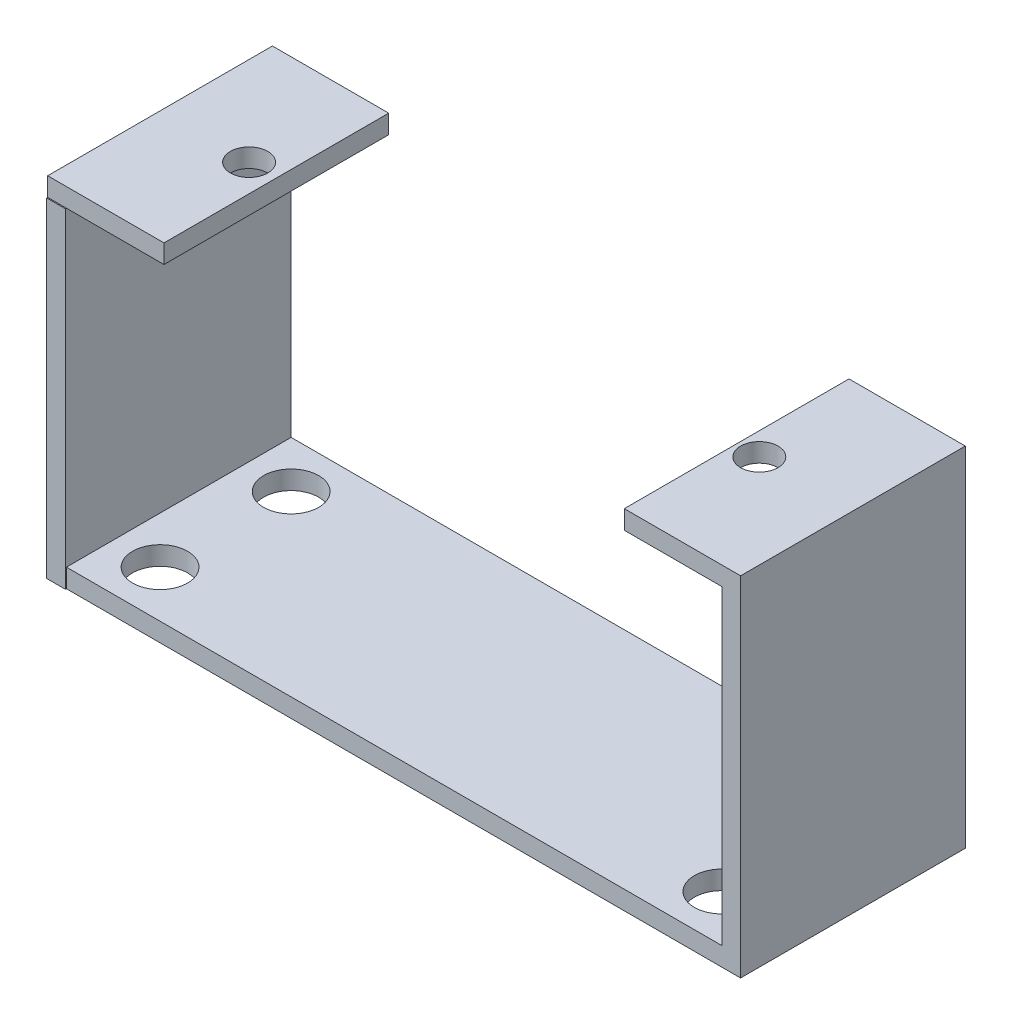
ISO-10303-21;
HEADER;
FILE_DESCRIPTION(('STEP AP214'),'2;1');
FILE_NAME('part.step','',(''),(''),'','','');
FILE_SCHEMA(('AUTOMOTIVE_DESIGN { 1 0 10303 214 1 1 1 1 }'));
ENDSEC;
DATA;
#1=APPLICATION_CONTEXT('core data for automotive mechanical design processes');
#2=APPLICATION_PROTOCOL_DEFINITION('international standard','automotive_design',2000,#1);
#3=PRODUCT_CONTEXT('',#1,'mechanical');
#4=PRODUCT('Part','Part','',(#3));
#5=PRODUCT_RELATED_PRODUCT_CATEGORY('part','',(#4));
#6=PRODUCT_DEFINITION_FORMATION('','',#4);
#7=PRODUCT_DEFINITION_CONTEXT('part definition',#1,'design');
#8=PRODUCT_DEFINITION('design','',#6,#7);
#9=PRODUCT_DEFINITION_SHAPE('','',#8);
#10=(LENGTH_UNIT() NAMED_UNIT(*) SI_UNIT(.MILLI.,.METRE.));
#11=(NAMED_UNIT(*) PLANE_ANGLE_UNIT() SI_UNIT($,.RADIAN.));
#12=(NAMED_UNIT(*) SI_UNIT($,.STERADIAN.) SOLID_ANGLE_UNIT());
#13=UNCERTAINTY_MEASURE_WITH_UNIT(LENGTH_MEASURE(1.E-05),#10,'distance_accuracy_value','');
#14=(GEOMETRIC_REPRESENTATION_CONTEXT(3) GLOBAL_UNCERTAINTY_ASSIGNED_CONTEXT((#13)) GLOBAL_UNIT_ASSIGNED_CONTEXT((#10,
#11,#12)) REPRESENTATION_CONTEXT('',''));
#15=CARTESIAN_POINT('',(0.,0.,0.));
#16=DIRECTION('',(0.,0.,1.));
#17=DIRECTION('',(1.,0.,0.));
#18=AXIS2_PLACEMENT_3D('',#15,#16,#17);
#19=CARTESIAN_POINT('',(-17.3190546528804,1.,8.56203840472674));
#20=DIRECTION('',(0.,0.,-1.));
#21=DIRECTION('',(-1.,0.,0.));
#22=AXIS2_PLACEMENT_3D('',#19,#20,#21);
#23=PLANE('',#22);
#24=DIRECTION('',(1.,0.,0.));
#25=VECTOR('',#24,1.);
#26=CARTESIAN_POINT('',(18.6809453471197,18.6,8.56203840472674));
#27=LINE('',#26,#25);
#28=CARTESIAN_POINT('',(12.4709453471196,18.6,8.56203840472674));
#29=VERTEX_POINT('',#28);
#30=CARTESIAN_POINT('',(18.6809453471197,18.6,8.56203840472674));
#31=VERTEX_POINT('',#30);
#32=EDGE_CURVE('E328',#29,#31,#27,.T.);
#33=ORIENTED_EDGE('',*,*,#32,.F.);
#34=DIRECTION('',(0.,1.,0.));
#35=VECTOR('',#34,1.);
#36=CARTESIAN_POINT('',(12.4709453471196,17.6,8.56203840472674));
#37=LINE('',#36,#35);
#38=CARTESIAN_POINT('',(12.4709453471196,17.6,8.56203840472674));
#39=VERTEX_POINT('',#38);
#40=EDGE_CURVE('E171',#39,#29,#37,.T.);
#41=ORIENTED_EDGE('',*,*,#40,.F.);
#42=DIRECTION('',(1.,0.,0.));
#43=VECTOR('',#42,1.);
#44=CARTESIAN_POINT('',(18.6809453471197,17.6,8.56203840472674));
#45=LINE('',#44,#43);
#46=CARTESIAN_POINT('',(17.6809453471197,17.6,8.56203840472674));
#47=VERTEX_POINT('',#46);
#48=EDGE_CURVE('E175',#39,#47,#45,.T.);
#49=ORIENTED_EDGE('',*,*,#48,.T.);
#50=DIRECTION('',(0.,-1.,0.));
#51=VECTOR('',#50,1.);
#52=CARTESIAN_POINT('',(17.6809453471197,0.,8.56203840472674));
#53=LINE('',#52,#51);
#54=CARTESIAN_POINT('',(17.6809453471197,1.,8.56203840472674));
#55=VERTEX_POINT('',#54);
#56=EDGE_CURVE('E192',#47,#55,#53,.T.);
#57=ORIENTED_EDGE('',*,*,#56,.T.);
#58=DIRECTION('',(1.,0.,0.));
#59=VECTOR('',#58,1.);
#60=CARTESIAN_POINT('',(-17.3190546528804,1.,8.56203840472674));
#61=LINE('',#60,#59);
#62=CARTESIAN_POINT('',(-17.3190546528804,1.,8.56203840472674));
#63=VERTEX_POINT('',#62);
#64=EDGE_CURVE('E255',#63,#55,#61,.T.);
#65=ORIENTED_EDGE('',*,*,#64,.F.);
#66=DIRECTION('',(0.,-1.,0.));
#67=VECTOR('',#66,1.);
#68=CARTESIAN_POINT('',(-17.3190546528804,1.,8.56203840472674));
#69=LINE('',#68,#67);
#70=CARTESIAN_POINT('',(-17.3190546528804,0.,8.56203840472673));
#71=VERTEX_POINT('',#70);
#72=EDGE_CURVE('E11',#63,#71,#69,.T.);
#73=ORIENTED_EDGE('',*,*,#72,.T.);
#74=DIRECTION('',(1.,0.,0.));
#75=VECTOR('',#74,1.);
#76=CARTESIAN_POINT('',(-17.3190546528804,0.,8.56203840472674));
#77=LINE('',#76,#75);
#78=CARTESIAN_POINT('',(18.6809453471197,0.,8.56203840472674));
#79=VERTEX_POINT('',#78);
#80=EDGE_CURVE('E250',#71,#79,#77,.T.);
#81=ORIENTED_EDGE('',*,*,#80,.T.);
#82=DIRECTION('',(0.,-1.,0.));
#83=VECTOR('',#82,1.);
#84=CARTESIAN_POINT('',(18.6809453471197,0.,8.56203840472674));
#85=LINE('',#84,#83);
#86=EDGE_CURVE('E193',#31,#79,#85,.T.);
#87=ORIENTED_EDGE('',*,*,#86,.F.);
#88=EDGE_LOOP('',(#33,#41,#49,#57,#65,#73,#81,#87));
#89=FACE_BOUND('',#88,.T.);
#90=ADVANCED_FACE('F39',(#89),#23,.F.);
#91=CARTESIAN_POINT('',(0.,18.6,0.));
#92=DIRECTION('',(0.,1.,0.));
#93=DIRECTION('',(0.,0.,1.));
#94=AXIS2_PLACEMENT_3D('',#91,#92,#93);
#95=PLANE('',#94);
#96=CARTESIAN_POINT('',(13.6809453471197,18.6,2.56203840472674));
#97=DIRECTION('',(0.,1.,0.));
#98=DIRECTION('',(0.,0.,1.));
#99=AXIS2_PLACEMENT_3D('',#96,#97,#98);
#100=CIRCLE('',#99,1.);
#101=CARTESIAN_POINT('',(13.6809453471197,18.6,3.56203840472674));
#102=VERTEX_POINT('',#101);
#103=EDGE_CURVE('E297',#102,#102,#100,.T.);
#104=ORIENTED_EDGE('',*,*,#103,.F.);
#105=EDGE_LOOP('',(#104));
#106=FACE_BOUND('',#105,.T.);
#107=DIRECTION('',(0.,0.,-1.));
#108=VECTOR('',#107,1.);
#109=CARTESIAN_POINT('',(12.4709453471196,18.6,8.56203840472674));
#110=LINE('',#109,#108);
#111=CARTESIAN_POINT('',(12.4709453471196,18.6,-3.43796159527326));
#112=VERTEX_POINT('',#111);
#113=EDGE_CURVE('E305',#29,#112,#110,.T.);
#114=ORIENTED_EDGE('',*,*,#113,.F.);
#115=ORIENTED_EDGE('',*,*,#32,.T.);
#116=DIRECTION('',(0.,0.,-1.));
#117=VECTOR('',#116,1.);
#118=CARTESIAN_POINT('',(18.6809453471197,18.6,8.56203840472674));
#119=LINE('',#118,#117);
#120=CARTESIAN_POINT('',(18.6809453471197,18.6,-3.43796159527326));
#121=VERTEX_POINT('',#120);
#122=EDGE_CURVE('E185',#31,#121,#119,.T.);
#123=ORIENTED_EDGE('',*,*,#122,.T.);
#124=DIRECTION('',(-1.,0.,0.));
#125=VECTOR('',#124,1.);
#126=CARTESIAN_POINT('',(18.6809453471197,18.6,-3.43796159527326));
#127=LINE('',#126,#125);
#128=EDGE_CURVE('E323',#121,#112,#127,.T.);
#129=ORIENTED_EDGE('',*,*,#128,.T.);
#130=EDGE_LOOP('',(#114,#115,#123,#129));
#131=FACE_BOUND('',#130,.T.);
#132=ADVANCED_FACE('F372',(#106,#131),#95,.T.);
#133=CARTESIAN_POINT('',(0.,17.6,0.));
#134=DIRECTION('',(0.,1.,0.));
#135=DIRECTION('',(0.,0.,1.));
#136=AXIS2_PLACEMENT_3D('',#133,#134,#135);
#137=PLANE('',#136);
#138=CARTESIAN_POINT('',(13.6809453471197,17.6,2.56203840472674));
#139=DIRECTION('',(0.,1.,0.));
#140=DIRECTION('',(0.,0.,1.));
#141=AXIS2_PLACEMENT_3D('',#138,#139,#140);
#142=CIRCLE('',#141,1.);
#143=CARTESIAN_POINT('',(13.6809453471197,17.6,3.56203840472674));
#144=VERTEX_POINT('',#143);
#145=EDGE_CURVE('E301',#144,#144,#142,.T.);
#146=ORIENTED_EDGE('',*,*,#145,.T.);
#147=EDGE_LOOP('',(#146));
#148=FACE_BOUND('',#147,.T.);
#149=ORIENTED_EDGE('',*,*,#48,.F.);
#150=DIRECTION('',(0.,0.,-1.));
#151=VECTOR('',#150,1.);
#152=CARTESIAN_POINT('',(12.4709453471196,17.6,8.56203840472674));
#153=LINE('',#152,#151);
#154=CARTESIAN_POINT('',(12.4709453471196,17.6,-3.43796159527326));
#155=VERTEX_POINT('',#154);
#156=EDGE_CURVE('E152',#39,#155,#153,.T.);
#157=ORIENTED_EDGE('',*,*,#156,.T.);
#158=DIRECTION('',(-1.,0.,0.));
#159=VECTOR('',#158,1.);
#160=CARTESIAN_POINT('',(18.6809453471197,17.6,-3.43796159527326));
#161=LINE('',#160,#159);
#162=CARTESIAN_POINT('',(17.6809453471197,17.6,-3.43796159527326));
#163=VERTEX_POINT('',#162);
#164=EDGE_CURVE('E170',#163,#155,#161,.T.);
#165=ORIENTED_EDGE('',*,*,#164,.F.);
#166=DIRECTION('',(0.,0.,1.));
#167=VECTOR('',#166,1.);
#168=CARTESIAN_POINT('',(17.6809453471197,17.6,8.56203840472674));
#169=LINE('',#168,#167);
#170=EDGE_CURVE('E198',#163,#47,#169,.T.);
#171=ORIENTED_EDGE('',*,*,#170,.T.);
#172=EDGE_LOOP('',(#149,#157,#165,#171));
#173=FACE_BOUND('',#172,.T.);
#174=ADVANCED_FACE('F352',(#148,#173),#137,.F.);
#175=CARTESIAN_POINT('',(-18.3190546528804,17.6,-3.43796159527326));
#176=DIRECTION('',(0.,-1.,0.));
#177=DIRECTION('',(0.,0.,-1.));
#178=AXIS2_PLACEMENT_3D('',#175,#176,#177);
#179=PLANE('',#178);
#180=CARTESIAN_POINT('',(-18.3190546528804,17.6,8.56203840472674));
#181=VERTEX_POINT('',#180);
#182=CARTESIAN_POINT('',(-17.3190546528804,17.6,8.56203840472674));
#183=VERTEX_POINT('',#182);
#184=EDGE_CURVE('E181',#181,#183,#45,.T.);
#185=ORIENTED_EDGE('',*,*,#184,.F.);
#186=DIRECTION('',(0.,0.,-1.));
#187=VECTOR('',#186,1.);
#188=CARTESIAN_POINT('',(-18.3190546528804,17.6,-3.43796159527326));
#189=LINE('',#188,#187);
#190=CARTESIAN_POINT('',(-18.3190546528804,17.6,8.61549422427288));
#191=VERTEX_POINT('',#190);
#192=EDGE_CURVE('E227',#191,#181,#189,.T.);
#193=ORIENTED_EDGE('',*,*,#192,.F.);
#194=DIRECTION('',(1.,0.,0.));
#195=VECTOR('',#194,1.);
#196=CARTESIAN_POINT('',(-18.3190546528804,17.6,8.61549422427288));
#197=LINE('',#196,#195);
#198=CARTESIAN_POINT('',(-17.3190546528804,17.6,8.61549422427288));
#199=VERTEX_POINT('',#198);
#200=EDGE_CURVE('E231',#191,#199,#197,.T.);
#201=ORIENTED_EDGE('',*,*,#200,.T.);
#202=DIRECTION('',(0.,0.,-1.));
#203=VECTOR('',#202,1.);
#204=CARTESIAN_POINT('',(-17.3190546528804,17.6,-3.43796159527326));
#205=LINE('',#204,#203);
#206=EDGE_CURVE('E221',#199,#183,#205,.T.);
#207=ORIENTED_EDGE('',*,*,#206,.T.);
#208=EDGE_LOOP('',(#185,#193,#201,#207));
#209=FACE_BOUND('',#208,.T.);
#210=ADVANCED_FACE('F380',(#209),#179,.F.);
#211=CARTESIAN_POINT('',(-12.1090546528804,17.6,8.56203840472674));
#212=VERTEX_POINT('',#211);
#213=EDGE_CURVE('E186',#183,#212,#45,.T.);
#214=ORIENTED_EDGE('',*,*,#213,.T.);
#215=DIRECTION('',(0.,1.,0.));
#216=VECTOR('',#215,1.);
#217=CARTESIAN_POINT('',(-12.1090546528804,17.6,8.56203840472674));
#218=LINE('',#217,#216);
#219=CARTESIAN_POINT('',(-12.1090546528804,18.6,8.56203840472674));
#220=VERTEX_POINT('',#219);
#221=EDGE_CURVE('E57',#212,#220,#218,.T.);
#222=ORIENTED_EDGE('',*,*,#221,.T.);
#223=CARTESIAN_POINT('',(-18.3190546528804,18.6,8.56203840472674));
#224=VERTEX_POINT('',#223);
#225=EDGE_CURVE('E179',#224,#220,#27,.T.);
#226=ORIENTED_EDGE('',*,*,#225,.F.);
#227=DIRECTION('',(0.,-1.,0.));
#228=VECTOR('',#227,1.);
#229=CARTESIAN_POINT('',(-18.3190546528804,18.6,8.56203840472674));
#230=LINE('',#229,#228);
#231=EDGE_CURVE('E187',#224,#181,#230,.T.);
#232=ORIENTED_EDGE('',*,*,#231,.T.);
#233=ORIENTED_EDGE('',*,*,#184,.T.);
#234=EDGE_LOOP('',(#214,#222,#226,#232,#233));
#235=FACE_BOUND('',#234,.T.);
#236=ADVANCED_FACE('F41',(#235),#23,.F.);
#237=CARTESIAN_POINT('',(-17.3190546528804,1.,-3.43796159527326));
#238=DIRECTION('',(0.,0.,1.));
#239=DIRECTION('',(1.,0.,0.));
#240=AXIS2_PLACEMENT_3D('',#237,#238,#239);
#241=PLANE('',#240);
#242=ORIENTED_EDGE('',*,*,#164,.T.);
#243=DIRECTION('',(0.,1.,0.));
#244=VECTOR('',#243,1.);
#245=CARTESIAN_POINT('',(12.4709453471196,17.6,-3.43796159527326));
#246=LINE('',#245,#244);
#247=EDGE_CURVE('E65',#155,#112,#246,.T.);
#248=ORIENTED_EDGE('',*,*,#247,.T.);
#249=ORIENTED_EDGE('',*,*,#128,.F.);
#250=DIRECTION('',(0.,1.,0.));
#251=VECTOR('',#250,1.);
#252=CARTESIAN_POINT('',(18.6809453471197,0.,-3.43796159527326));
#253=LINE('',#252,#251);
#254=CARTESIAN_POINT('',(18.6809453471197,0.,-3.43796159527326));
#255=VERTEX_POINT('',#254);
#256=EDGE_CURVE('E202',#255,#121,#253,.T.);
#257=ORIENTED_EDGE('',*,*,#256,.F.);
#258=DIRECTION('',(-1.,0.,0.));
#259=VECTOR('',#258,1.);
#260=CARTESIAN_POINT('',(-17.3190546528804,0.,-3.43796159527326));
#261=LINE('',#260,#259);
#262=CARTESIAN_POINT('',(-18.3190546528804,0.,-3.43796159527326));
#263=VERTEX_POINT('',#262);
#264=EDGE_CURVE('E256',#255,#263,#261,.T.);
#265=ORIENTED_EDGE('',*,*,#264,.T.);
#266=DIRECTION('',(0.,-1.,0.));
#267=VECTOR('',#266,1.);
#268=CARTESIAN_POINT('',(-18.3190546528804,0.,-3.43796159527326));
#269=LINE('',#268,#267);
#270=CARTESIAN_POINT('',(-18.3190546528804,18.6,-3.43796159527326));
#271=VERTEX_POINT('',#270);
#272=EDGE_CURVE('E216',#271,#263,#269,.T.);
#273=ORIENTED_EDGE('',*,*,#272,.F.);
#274=CARTESIAN_POINT('',(-12.1090546528804,18.6,-3.43796159527326));
#275=VERTEX_POINT('',#274);
#276=EDGE_CURVE('E162',#275,#271,#127,.T.);
#277=ORIENTED_EDGE('',*,*,#276,.F.);
#278=DIRECTION('',(0.,1.,0.));
#279=VECTOR('',#278,1.);
#280=CARTESIAN_POINT('',(-12.1090546528804,17.6,-3.43796159527326));
#281=LINE('',#280,#279);
#282=CARTESIAN_POINT('',(-12.1090546528804,17.6,-3.43796159527326));
#283=VERTEX_POINT('',#282);
#284=EDGE_CURVE('E146',#283,#275,#281,.T.);
#285=ORIENTED_EDGE('',*,*,#284,.F.);
#286=CARTESIAN_POINT('',(-17.3190546528804,17.6,-3.43796159527326));
#287=VERTEX_POINT('',#286);
#288=EDGE_CURVE('E159',#283,#287,#161,.T.);
#289=ORIENTED_EDGE('',*,*,#288,.T.);
#290=DIRECTION('',(0.,-1.,0.));
#291=VECTOR('',#290,1.);
#292=CARTESIAN_POINT('',(-17.3190546528804,0.,-3.43796159527326));
#293=LINE('',#292,#291);
#294=CARTESIAN_POINT('',(-17.3190546528804,1.,-3.43796159527326));
#295=VERTEX_POINT('',#294);
#296=EDGE_CURVE('E205',#287,#295,#293,.T.);
#297=ORIENTED_EDGE('',*,*,#296,.T.);
#298=DIRECTION('',(-1.,0.,0.));
#299=VECTOR('',#298,1.);
#300=CARTESIAN_POINT('',(-17.3190546528804,1.,-3.43796159527326));
#301=LINE('',#300,#299);
#302=CARTESIAN_POINT('',(17.6809453471197,1.,-3.43796159527326));
#303=VERTEX_POINT('',#302);
#304=EDGE_CURVE('E49',#303,#295,#301,.T.);
#305=ORIENTED_EDGE('',*,*,#304,.F.);
#306=DIRECTION('',(0.,1.,0.));
#307=VECTOR('',#306,1.);
#308=CARTESIAN_POINT('',(17.6809453471197,0.,-3.43796159527326));
#309=LINE('',#308,#307);
#310=EDGE_CURVE('E209',#303,#163,#309,.T.);
#311=ORIENTED_EDGE('',*,*,#310,.T.);
#312=EDGE_LOOP('',(#242,#248,#249,#257,#265,#273,#277,#285,#289,#297,#305,#311));
#313=FACE_BOUND('',#312,.T.);
#314=ADVANCED_FACE('F157',(#313),#241,.F.);
#315=CARTESIAN_POINT('',(0.,1.,0.));
#316=DIRECTION('',(0.,1.,0.));
#317=DIRECTION('',(0.,0.,1.));
#318=AXIS2_PLACEMENT_3D('',#315,#316,#317);
#319=PLANE('',#318);
#320=CARTESIAN_POINT('',(15.1809453471197,1.,6.06203840472674));
#321=DIRECTION('',(0.,1.,0.));
#322=DIRECTION('',(0.,0.,1.));
#323=AXIS2_PLACEMENT_3D('',#320,#321,#322);
#324=CIRCLE('',#323,1.47);
#325=CARTESIAN_POINT('',(15.1809453471197,1.,7.53203840472674));
#326=VERTEX_POINT('',#325);
#327=EDGE_CURVE('E470',#326,#326,#324,.T.);
#328=ORIENTED_EDGE('',*,*,#327,.F.);
#329=EDGE_LOOP('',(#328));
#330=FACE_BOUND('',#329,.T.);
#331=CARTESIAN_POINT('',(-14.8190546528804,1.,-0.937961595273264));
#332=DIRECTION('',(0.,1.,0.));
#333=DIRECTION('',(0.,0.,1.));
#334=AXIS2_PLACEMENT_3D('',#331,#332,#333);
#335=CIRCLE('',#334,1.47);
#336=CARTESIAN_POINT('',(-14.8190546528804,1.,0.532038404726734));
#337=VERTEX_POINT('',#336);
#338=EDGE_CURVE('E474',#337,#337,#335,.T.);
#339=ORIENTED_EDGE('',*,*,#338,.F.);
#340=EDGE_LOOP('',(#339));
#341=FACE_BOUND('',#340,.T.);
#342=CARTESIAN_POINT('',(-14.8190546528804,1.,6.06203840472673));
#343=DIRECTION('',(0.,1.,0.));
#344=DIRECTION('',(0.,0.,1.));
#345=AXIS2_PLACEMENT_3D('',#342,#343,#344);
#346=CIRCLE('',#345,1.47);
#347=CARTESIAN_POINT('',(-14.8190546528804,1.,7.53203840472673));
#348=VERTEX_POINT('',#347);
#349=EDGE_CURVE('E451',#348,#348,#346,.T.);
#350=ORIENTED_EDGE('',*,*,#349,.F.);
#351=EDGE_LOOP('',(#350));
#352=FACE_BOUND('',#351,.T.);
#353=CARTESIAN_POINT('',(15.1809453471197,1.,-0.937961595273264));
#354=DIRECTION('',(0.,1.,0.));
#355=DIRECTION('',(0.,0.,1.));
#356=AXIS2_PLACEMENT_3D('',#353,#354,#355);
#357=CIRCLE('',#356,1.47);
#358=CARTESIAN_POINT('',(15.1809453471197,1.,0.532038404726738));
#359=VERTEX_POINT('',#358);
#360=EDGE_CURVE('E276',#359,#359,#357,.T.);
#361=ORIENTED_EDGE('',*,*,#360,.F.);
#362=EDGE_LOOP('',(#361));
#363=FACE_BOUND('',#362,.T.);
#364=DIRECTION('',(0.,0.,1.));
#365=VECTOR('',#364,1.);
#366=CARTESIAN_POINT('',(-17.3190546528804,1.,-3.43796159527326));
#367=LINE('',#366,#365);
#368=EDGE_CURVE('E251',#295,#63,#367,.T.);
#369=ORIENTED_EDGE('',*,*,#368,.T.);
#370=ORIENTED_EDGE('',*,*,#64,.T.);
#371=DIRECTION('',(0.,0.,-1.));
#372=VECTOR('',#371,1.);
#373=CARTESIAN_POINT('',(17.6809453471197,1.,-3.43796159527326));
#374=LINE('',#373,#372);
#375=EDGE_CURVE('E260',#55,#303,#374,.T.);
#376=ORIENTED_EDGE('',*,*,#375,.T.);
#377=ORIENTED_EDGE('',*,*,#304,.T.);
#378=EDGE_LOOP('',(#369,#370,#376,#377));
#379=FACE_BOUND('',#378,.T.);
#380=ADVANCED_FACE('F357',(#330,#341,#352,#363,#379),#319,.T.);
#381=CARTESIAN_POINT('',(0.,0.,0.));
#382=DIRECTION('',(0.,1.,0.));
#383=DIRECTION('',(0.,0.,1.));
#384=AXIS2_PLACEMENT_3D('',#381,#382,#383);
#385=PLANE('',#384);
#386=CARTESIAN_POINT('',(15.1809453471197,0.,6.06203840472674));
#387=DIRECTION('',(0.,1.,0.));
#388=DIRECTION('',(0.,0.,1.));
#389=AXIS2_PLACEMENT_3D('',#386,#387,#388);
#390=CIRCLE('',#389,1.47);
#391=CARTESIAN_POINT('',(15.1809453471197,0.,7.53203840472674));
#392=VERTEX_POINT('',#391);
#393=EDGE_CURVE('E43',#392,#392,#390,.T.);
#394=ORIENTED_EDGE('',*,*,#393,.T.);
#395=EDGE_LOOP('',(#394));
#396=FACE_BOUND('',#395,.T.);
#397=CARTESIAN_POINT('',(-14.8190546528804,0.,-0.937961595273264));
#398=DIRECTION('',(0.,1.,0.));
#399=DIRECTION('',(0.,0.,1.));
#400=AXIS2_PLACEMENT_3D('',#397,#398,#399);
#401=CIRCLE('',#400,1.47);
#402=CARTESIAN_POINT('',(-14.8190546528804,0.,0.532038404726734));
#403=VERTEX_POINT('',#402);
#404=EDGE_CURVE('E279',#403,#403,#401,.T.);
#405=ORIENTED_EDGE('',*,*,#404,.T.);
#406=EDGE_LOOP('',(#405));
#407=FACE_BOUND('',#406,.T.);
#408=CARTESIAN_POINT('',(-14.8190546528804,0.,6.06203840472673));
#409=DIRECTION('',(0.,1.,0.));
#410=DIRECTION('',(0.,0.,1.));
#411=AXIS2_PLACEMENT_3D('',#408,#409,#410);
#412=CIRCLE('',#411,1.47);
#413=CARTESIAN_POINT('',(-14.8190546528804,0.,7.53203840472673));
#414=VERTEX_POINT('',#413);
#415=EDGE_CURVE('E275',#414,#414,#412,.T.);
#416=ORIENTED_EDGE('',*,*,#415,.T.);
#417=EDGE_LOOP('',(#416));
#418=FACE_BOUND('',#417,.T.);
#419=CARTESIAN_POINT('',(15.1809453471197,0.,-0.937961595273264));
#420=DIRECTION('',(0.,1.,0.));
#421=DIRECTION('',(0.,0.,1.));
#422=AXIS2_PLACEMENT_3D('',#419,#420,#421);
#423=CIRCLE('',#422,1.47);
#424=CARTESIAN_POINT('',(15.1809453471197,0.,0.532038404726738));
#425=VERTEX_POINT('',#424);
#426=EDGE_CURVE('E271',#425,#425,#423,.T.);
#427=ORIENTED_EDGE('',*,*,#426,.T.);
#428=EDGE_LOOP('',(#427));
#429=FACE_BOUND('',#428,.T.);
#430=ORIENTED_EDGE('',*,*,#80,.F.);
#431=DIRECTION('',(0.,0.,1.));
#432=VECTOR('',#431,1.);
#433=CARTESIAN_POINT('',(-17.3190546528804,0.,-3.43796159527326));
#434=LINE('',#433,#432);
#435=CARTESIAN_POINT('',(-17.3190546528804,0.,8.61549422427288));
#436=VERTEX_POINT('',#435);
#437=EDGE_CURVE('E234',#71,#436,#434,.T.);
#438=ORIENTED_EDGE('',*,*,#437,.T.);
#439=DIRECTION('',(1.,0.,0.));
#440=VECTOR('',#439,1.);
#441=CARTESIAN_POINT('',(-18.3190546528804,0.,8.61549422427288));
#442=LINE('',#441,#440);
#443=CARTESIAN_POINT('',(-18.3190546528804,0.,8.61549422427288));
#444=VERTEX_POINT('',#443);
#445=EDGE_CURVE('E246',#444,#436,#442,.T.);
#446=ORIENTED_EDGE('',*,*,#445,.F.);
#447=DIRECTION('',(0.,0.,1.));
#448=VECTOR('',#447,1.);
#449=CARTESIAN_POINT('',(-18.3190546528804,0.,-3.43796159527326));
#450=LINE('',#449,#448);
#451=EDGE_CURVE('E220',#263,#444,#450,.T.);
#452=ORIENTED_EDGE('',*,*,#451,.F.);
#453=ORIENTED_EDGE('',*,*,#264,.F.);
#454=DIRECTION('',(0.,0.,-1.));
#455=VECTOR('',#454,1.);
#456=CARTESIAN_POINT('',(18.6809453471197,0.,8.56203840472674));
#457=LINE('',#456,#455);
#458=EDGE_CURVE('E197',#79,#255,#457,.T.);
#459=ORIENTED_EDGE('',*,*,#458,.F.);
#460=EDGE_LOOP('',(#430,#438,#446,#452,#453,#459));
#461=FACE_BOUND('',#460,.T.);
#462=ADVANCED_FACE('F366',(#396,#407,#418,#429,#461),#385,.F.);
#463=CARTESIAN_POINT('',(-17.3190546528804,0.,0.));
#464=DIRECTION('',(1.,0.,0.));
#465=DIRECTION('',(0.,0.,-1.));
#466=AXIS2_PLACEMENT_3D('',#463,#464,#465);
#467=PLANE('',#466);
#468=ORIENTED_EDGE('',*,*,#72,.F.);
#469=ORIENTED_EDGE('',*,*,#368,.F.);
#470=ORIENTED_EDGE('',*,*,#296,.F.);
#471=DIRECTION('',(0.,0.,1.));
#472=VECTOR('',#471,1.);
#473=CARTESIAN_POINT('',(-17.3190546528804,17.6,0.));
#474=LINE('',#473,#472);
#475=EDGE_CURVE('E167',#287,#183,#474,.T.);
#476=ORIENTED_EDGE('',*,*,#475,.T.);
#477=ORIENTED_EDGE('',*,*,#206,.F.);
#478=DIRECTION('',(0.,1.,0.));
#479=VECTOR('',#478,1.);
#480=CARTESIAN_POINT('',(-17.3190546528804,0.,8.61549422427288));
#481=LINE('',#480,#479);
#482=EDGE_CURVE('E237',#436,#199,#481,.T.);
#483=ORIENTED_EDGE('',*,*,#482,.F.);
#484=ORIENTED_EDGE('',*,*,#437,.F.);
#485=EDGE_LOOP('',(#468,#469,#470,#476,#477,#483,#484));
#486=FACE_BOUND('',#485,.T.);
#487=ADVANCED_FACE('F359',(#486),#467,.T.);
#488=CARTESIAN_POINT('',(-18.3190546528804,0.,8.61549422427288));
#489=DIRECTION('',(0.,0.,-1.));
#490=DIRECTION('',(-1.,0.,0.));
#491=AXIS2_PLACEMENT_3D('',#488,#489,#490);
#492=PLANE('',#491);
#493=ORIENTED_EDGE('',*,*,#482,.T.);
#494=ORIENTED_EDGE('',*,*,#200,.F.);
#495=DIRECTION('',(0.,1.,0.));
#496=VECTOR('',#495,1.);
#497=CARTESIAN_POINT('',(-18.3190546528804,0.,8.61549422427288));
#498=LINE('',#497,#496);
#499=EDGE_CURVE('E224',#444,#191,#498,.T.);
#500=ORIENTED_EDGE('',*,*,#499,.F.);
#501=ORIENTED_EDGE('',*,*,#445,.T.);
#502=EDGE_LOOP('',(#493,#494,#500,#501));
#503=FACE_BOUND('',#502,.T.);
#504=ADVANCED_FACE('F382',(#503),#492,.F.);
#505=CARTESIAN_POINT('',(-18.3190546528804,0.,0.));
#506=DIRECTION('',(1.,0.,0.));
#507=DIRECTION('',(0.,0.,-1.));
#508=AXIS2_PLACEMENT_3D('',#505,#506,#507);
#509=PLANE('',#508);
#510=ORIENTED_EDGE('',*,*,#272,.T.);
#511=ORIENTED_EDGE('',*,*,#451,.T.);
#512=ORIENTED_EDGE('',*,*,#499,.T.);
#513=ORIENTED_EDGE('',*,*,#192,.T.);
#514=ORIENTED_EDGE('',*,*,#231,.F.);
#515=DIRECTION('',(0.,0.,1.));
#516=VECTOR('',#515,1.);
#517=CARTESIAN_POINT('',(-18.3190546528804,18.6,8.56203840472674));
#518=LINE('',#517,#516);
#519=EDGE_CURVE('E326',#271,#224,#518,.T.);
#520=ORIENTED_EDGE('',*,*,#519,.F.);
#521=EDGE_LOOP('',(#510,#511,#512,#513,#514,#520));
#522=FACE_BOUND('',#521,.T.);
#523=ADVANCED_FACE('F376',(#522),#509,.F.);
#524=CARTESIAN_POINT('',(17.6809453471197,0.,0.));
#525=DIRECTION('',(-1.,0.,0.));
#526=DIRECTION('',(0.,0.,1.));
#527=AXIS2_PLACEMENT_3D('',#524,#525,#526);
#528=PLANE('',#527);
#529=ORIENTED_EDGE('',*,*,#375,.F.);
#530=ORIENTED_EDGE('',*,*,#56,.F.);
#531=ORIENTED_EDGE('',*,*,#170,.F.);
#532=ORIENTED_EDGE('',*,*,#310,.F.);
#533=EDGE_LOOP('',(#529,#530,#531,#532));
#534=FACE_BOUND('',#533,.T.);
#535=ADVANCED_FACE('F354',(#534),#528,.T.);
#536=CARTESIAN_POINT('',(18.6809453471197,0.,0.));
#537=DIRECTION('',(-1.,0.,0.));
#538=DIRECTION('',(0.,0.,1.));
#539=AXIS2_PLACEMENT_3D('',#536,#537,#538);
#540=PLANE('',#539);
#541=ORIENTED_EDGE('',*,*,#86,.T.);
#542=ORIENTED_EDGE('',*,*,#458,.T.);
#543=ORIENTED_EDGE('',*,*,#256,.T.);
#544=ORIENTED_EDGE('',*,*,#122,.F.);
#545=EDGE_LOOP('',(#541,#542,#543,#544));
#546=FACE_BOUND('',#545,.T.);
#547=ADVANCED_FACE('F370',(#546),#540,.F.);
#548=CARTESIAN_POINT('',(-13.5690544530361,18.6,2.55873817580405));
#549=DIRECTION('',(0.,1.,0.));
#550=DIRECTION('',(0.,0.,1.));
#551=AXIS2_PLACEMENT_3D('',#548,#549,#550);
#552=CIRCLE('',#551,1.);
#553=CARTESIAN_POINT('',(-13.5690544530361,18.6,3.55873817580405));
#554=VERTEX_POINT('',#553);
#555=EDGE_CURVE('E286',#554,#554,#552,.T.);
#556=ORIENTED_EDGE('',*,*,#555,.F.);
#557=EDGE_LOOP('',(#556));
#558=FACE_BOUND('',#557,.T.);
#559=DIRECTION('',(0.,0.,1.));
#560=VECTOR('',#559,1.);
#561=CARTESIAN_POINT('',(-12.1090546528804,18.6,8.56203840472674));
#562=LINE('',#561,#560);
#563=EDGE_CURVE('E310',#275,#220,#562,.T.);
#564=ORIENTED_EDGE('',*,*,#563,.F.);
#565=ORIENTED_EDGE('',*,*,#276,.T.);
#566=ORIENTED_EDGE('',*,*,#519,.T.);
#567=ORIENTED_EDGE('',*,*,#225,.T.);
#568=EDGE_LOOP('',(#564,#565,#566,#567));
#569=FACE_BOUND('',#568,.T.);
#570=ADVANCED_FACE('F340',(#558,#569),#95,.T.);
#571=CARTESIAN_POINT('',(-13.5690544530361,17.6,2.55873817580405));
#572=DIRECTION('',(0.,1.,0.));
#573=DIRECTION('',(0.,0.,1.));
#574=AXIS2_PLACEMENT_3D('',#571,#572,#573);
#575=CIRCLE('',#574,1.);
#576=CARTESIAN_POINT('',(-13.5690544530361,17.6,3.55873817580405));
#577=VERTEX_POINT('',#576);
#578=EDGE_CURVE('E291',#577,#577,#575,.T.);
#579=ORIENTED_EDGE('',*,*,#578,.T.);
#580=EDGE_LOOP('',(#579));
#581=FACE_BOUND('',#580,.T.);
#582=ORIENTED_EDGE('',*,*,#288,.F.);
#583=DIRECTION('',(0.,0.,1.));
#584=VECTOR('',#583,1.);
#585=CARTESIAN_POINT('',(-12.1090546528804,17.6,8.56203840472674));
#586=LINE('',#585,#584);
#587=EDGE_CURVE('E143',#283,#212,#586,.T.);
#588=ORIENTED_EDGE('',*,*,#587,.T.);
#589=ORIENTED_EDGE('',*,*,#213,.F.);
#590=ORIENTED_EDGE('',*,*,#475,.F.);
#591=EDGE_LOOP('',(#582,#588,#589,#590));
#592=FACE_BOUND('',#591,.T.);
#593=ADVANCED_FACE('F165',(#581,#592),#137,.F.);
#594=CARTESIAN_POINT('',(-12.1090546528804,17.6,8.56203840472674));
#595=DIRECTION('',(-1.,0.,0.));
#596=DIRECTION('',(0.,0.,1.));
#597=AXIS2_PLACEMENT_3D('',#594,#595,#596);
#598=PLANE('',#597);
#599=ORIENTED_EDGE('',*,*,#563,.T.);
#600=ORIENTED_EDGE('',*,*,#221,.F.);
#601=ORIENTED_EDGE('',*,*,#587,.F.);
#602=ORIENTED_EDGE('',*,*,#284,.T.);
#603=EDGE_LOOP('',(#599,#600,#601,#602));
#604=FACE_BOUND('',#603,.T.);
#605=ADVANCED_FACE('F145',(#604),#598,.F.);
#606=CARTESIAN_POINT('',(12.4709453471196,17.6,8.56203840472674));
#607=DIRECTION('',(1.,0.,0.));
#608=DIRECTION('',(0.,0.,-1.));
#609=AXIS2_PLACEMENT_3D('',#606,#607,#608);
#610=PLANE('',#609);
#611=ORIENTED_EDGE('',*,*,#113,.T.);
#612=ORIENTED_EDGE('',*,*,#247,.F.);
#613=ORIENTED_EDGE('',*,*,#156,.F.);
#614=ORIENTED_EDGE('',*,*,#40,.T.);
#615=EDGE_LOOP('',(#611,#612,#613,#614));
#616=FACE_BOUND('',#615,.T.);
#617=ADVANCED_FACE('F418',(#616),#610,.F.);
#618=CARTESIAN_POINT('',(13.6809453471197,17.6,2.56203840472674));
#619=DIRECTION('',(0.,1.,0.));
#620=DIRECTION('',(0.,0.,1.));
#621=AXIS2_PLACEMENT_3D('',#618,#619,#620);
#622=CYLINDRICAL_SURFACE('',#621,1.);
#623=ORIENTED_EDGE('',*,*,#145,.F.);
#624=EDGE_LOOP('',(#623));
#625=FACE_BOUND('',#624,.T.);
#626=ORIENTED_EDGE('',*,*,#103,.T.);
#627=EDGE_LOOP('',(#626));
#628=FACE_BOUND('',#627,.T.);
#629=ADVANCED_FACE('F421',(#625,#628),#622,.F.);
#630=CARTESIAN_POINT('',(-13.5690544530361,17.6,2.55873817580405));
#631=DIRECTION('',(0.,1.,0.));
#632=DIRECTION('',(0.,0.,1.));
#633=AXIS2_PLACEMENT_3D('',#630,#631,#632);
#634=CYLINDRICAL_SURFACE('',#633,1.);
#635=ORIENTED_EDGE('',*,*,#578,.F.);
#636=EDGE_LOOP('',(#635));
#637=FACE_BOUND('',#636,.T.);
#638=ORIENTED_EDGE('',*,*,#555,.T.);
#639=EDGE_LOOP('',(#638));
#640=FACE_BOUND('',#639,.T.);
#641=ADVANCED_FACE('F426',(#637,#640),#634,.F.);
#642=CARTESIAN_POINT('',(15.1809453471197,-9.,-0.937961595273264));
#643=DIRECTION('',(0.,1.,0.));
#644=DIRECTION('',(0.,0.,1.));
#645=AXIS2_PLACEMENT_3D('',#642,#643,#644);
#646=CYLINDRICAL_SURFACE('',#645,1.47);
#647=ORIENTED_EDGE('',*,*,#360,.T.);
#648=EDGE_LOOP('',(#647));
#649=FACE_BOUND('',#648,.T.);
#650=ORIENTED_EDGE('',*,*,#426,.F.);
#651=EDGE_LOOP('',(#650));
#652=FACE_BOUND('',#651,.T.);
#653=ADVANCED_FACE('F430',(#649,#652),#646,.F.);
#654=CARTESIAN_POINT('',(-14.8190546528804,-9.,6.06203840472673));
#655=DIRECTION('',(0.,1.,0.));
#656=DIRECTION('',(0.,0.,1.));
#657=AXIS2_PLACEMENT_3D('',#654,#655,#656);
#658=CYLINDRICAL_SURFACE('',#657,1.47);
#659=ORIENTED_EDGE('',*,*,#349,.T.);
#660=EDGE_LOOP('',(#659));
#661=FACE_BOUND('',#660,.T.);
#662=ORIENTED_EDGE('',*,*,#415,.F.);
#663=EDGE_LOOP('',(#662));
#664=FACE_BOUND('',#663,.T.);
#665=ADVANCED_FACE('F434',(#661,#664),#658,.F.);
#666=CARTESIAN_POINT('',(-14.8190546528804,-9.,-0.937961595273264));
#667=DIRECTION('',(0.,1.,0.));
#668=DIRECTION('',(0.,0.,1.));
#669=AXIS2_PLACEMENT_3D('',#666,#667,#668);
#670=CYLINDRICAL_SURFACE('',#669,1.47);
#671=ORIENTED_EDGE('',*,*,#338,.T.);
#672=EDGE_LOOP('',(#671));
#673=FACE_BOUND('',#672,.T.);
#674=ORIENTED_EDGE('',*,*,#404,.F.);
#675=EDGE_LOOP('',(#674));
#676=FACE_BOUND('',#675,.T.);
#677=ADVANCED_FACE('F436',(#673,#676),#670,.F.);
#678=CARTESIAN_POINT('',(15.1809453471197,-9.,6.06203840472674));
#679=DIRECTION('',(0.,1.,0.));
#680=DIRECTION('',(0.,0.,1.));
#681=AXIS2_PLACEMENT_3D('',#678,#679,#680);
#682=CYLINDRICAL_SURFACE('',#681,1.47);
#683=ORIENTED_EDGE('',*,*,#327,.T.);
#684=EDGE_LOOP('',(#683));
#685=FACE_BOUND('',#684,.T.);
#686=ORIENTED_EDGE('',*,*,#393,.F.);
#687=EDGE_LOOP('',(#686));
#688=FACE_BOUND('',#687,.T.);
#689=ADVANCED_FACE('F439',(#685,#688),#682,.F.);
#690=CLOSED_SHELL('',(#90,#132,#174,#210,#236,#314,#380,#462,#487,#504,#523,#535,#547,#570,#593,
#605,#617,#629,#641,#653,#665,#677,#689));
#691=MANIFOLD_SOLID_BREP('B2',#690);
#692=ADVANCED_BREP_SHAPE_REPRESENTATION('',(#18,#691),#14);
#693=SHAPE_DEFINITION_REPRESENTATION(#9,#692);
ENDSEC;
END-ISO-10303-21;
